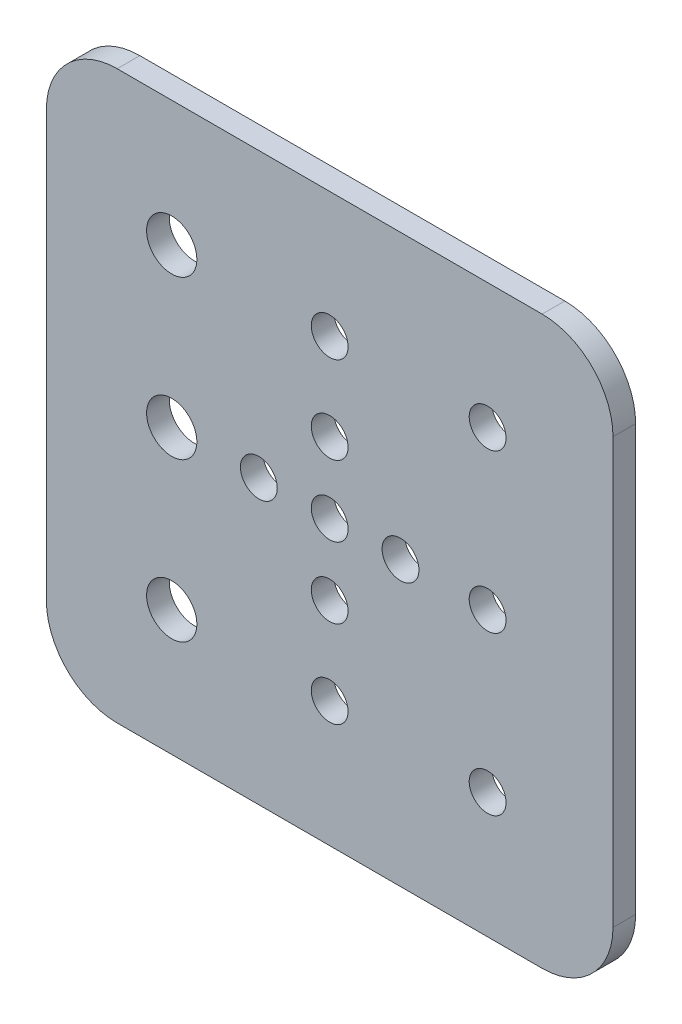
ISO-10303-21;
HEADER;
FILE_DESCRIPTION(('STEP AP214'),'2;1');
FILE_NAME('part.step','',(''),(''),'','','');
FILE_SCHEMA(('AUTOMOTIVE_DESIGN { 1 0 10303 214 1 1 1 1 }'));
ENDSEC;
DATA;
#1=APPLICATION_CONTEXT('core data for automotive mechanical design processes');
#2=APPLICATION_PROTOCOL_DEFINITION('international standard','automotive_design',2000,#1);
#3=PRODUCT_CONTEXT('',#1,'mechanical');
#4=PRODUCT('Part','Part','',(#3));
#5=PRODUCT_RELATED_PRODUCT_CATEGORY('part','',(#4));
#6=PRODUCT_DEFINITION_FORMATION('','',#4);
#7=PRODUCT_DEFINITION_CONTEXT('part definition',#1,'design');
#8=PRODUCT_DEFINITION('design','',#6,#7);
#9=PRODUCT_DEFINITION_SHAPE('','',#8);
#10=(LENGTH_UNIT() NAMED_UNIT(*) SI_UNIT(.MILLI.,.METRE.));
#11=(NAMED_UNIT(*) PLANE_ANGLE_UNIT() SI_UNIT($,.RADIAN.));
#12=(NAMED_UNIT(*) SI_UNIT($,.STERADIAN.) SOLID_ANGLE_UNIT());
#13=UNCERTAINTY_MEASURE_WITH_UNIT(LENGTH_MEASURE(1.E-05),#10,'distance_accuracy_value','');
#14=(GEOMETRIC_REPRESENTATION_CONTEXT(3) GLOBAL_UNCERTAINTY_ASSIGNED_CONTEXT((#13)) GLOBAL_UNIT_ASSIGNED_CONTEXT((#10,
#11,#12)) REPRESENTATION_CONTEXT('',''));
#15=CARTESIAN_POINT('',(0.,0.,0.));
#16=DIRECTION('',(0.,0.,1.));
#17=DIRECTION('',(1.,0.,0.));
#18=AXIS2_PLACEMENT_3D('',#15,#16,#17);
#19=CARTESIAN_POINT('',(0.,0.,3.2));
#20=DIRECTION('',(0.,0.,1.));
#21=DIRECTION('',(1.,0.,0.));
#22=AXIS2_PLACEMENT_3D('',#19,#20,#21);
#23=PLANE('',#22);
#24=CARTESIAN_POINT('',(-22.3,-22.3,3.2));
#25=DIRECTION('',(0.,0.,1.));
#26=DIRECTION('',(1.,0.,0.));
#27=AXIS2_PLACEMENT_3D('',#24,#25,#26);
#28=CIRCLE('',#27,3.55);
#29=CARTESIAN_POINT('',(-18.75,-22.3,3.2));
#30=VERTEX_POINT('',#29);
#31=EDGE_CURVE('E234',#30,#30,#28,.T.);
#32=ORIENTED_EDGE('',*,*,#31,.F.);
#33=EDGE_LOOP('',(#32));
#34=FACE_BOUND('',#33,.T.);
#35=CARTESIAN_POINT('',(22.3,22.3,3.2));
#36=DIRECTION('',(0.,0.,1.));
#37=DIRECTION('',(1.,0.,0.));
#38=AXIS2_PLACEMENT_3D('',#35,#36,#37);
#39=CIRCLE('',#38,2.6);
#40=CARTESIAN_POINT('',(24.9,22.3,3.2));
#41=VERTEX_POINT('',#40);
#42=EDGE_CURVE('E222',#41,#41,#39,.T.);
#43=ORIENTED_EDGE('',*,*,#42,.F.);
#44=EDGE_LOOP('',(#43));
#45=FACE_BOUND('',#44,.T.);
#46=CARTESIAN_POINT('',(-22.3,0.,3.2));
#47=DIRECTION('',(0.,0.,1.));
#48=DIRECTION('',(1.,0.,0.));
#49=AXIS2_PLACEMENT_3D('',#46,#47,#48);
#50=CIRCLE('',#49,3.55);
#51=CARTESIAN_POINT('',(-18.75,0.,3.2));
#52=VERTEX_POINT('',#51);
#53=EDGE_CURVE('E210',#52,#52,#50,.T.);
#54=ORIENTED_EDGE('',*,*,#53,.F.);
#55=EDGE_LOOP('',(#54));
#56=FACE_BOUND('',#55,.T.);
#57=CARTESIAN_POINT('',(10.,0.,3.2));
#58=DIRECTION('',(0.,0.,1.));
#59=DIRECTION('',(1.,0.,0.));
#60=AXIS2_PLACEMENT_3D('',#57,#58,#59);
#61=CIRCLE('',#60,2.6);
#62=CARTESIAN_POINT('',(12.6,0.,3.2));
#63=VERTEX_POINT('',#62);
#64=EDGE_CURVE('E198',#63,#63,#61,.T.);
#65=ORIENTED_EDGE('',*,*,#64,.F.);
#66=EDGE_LOOP('',(#65));
#67=FACE_BOUND('',#66,.T.);
#68=CARTESIAN_POINT('',(0.,-10.,3.2));
#69=DIRECTION('',(0.,0.,1.));
#70=DIRECTION('',(1.,0.,0.));
#71=AXIS2_PLACEMENT_3D('',#68,#69,#70);
#72=CIRCLE('',#71,2.6);
#73=CARTESIAN_POINT('',(2.60000000000001,-10.,3.2));
#74=VERTEX_POINT('',#73);
#75=EDGE_CURVE('E186',#74,#74,#72,.T.);
#76=ORIENTED_EDGE('',*,*,#75,.F.);
#77=EDGE_LOOP('',(#76));
#78=FACE_BOUND('',#77,.T.);
#79=CARTESIAN_POINT('',(0.,10.,3.2));
#80=DIRECTION('',(0.,0.,1.));
#81=DIRECTION('',(1.,0.,0.));
#82=AXIS2_PLACEMENT_3D('',#79,#80,#81);
#83=CIRCLE('',#82,2.6);
#84=CARTESIAN_POINT('',(2.6,10.,3.2));
#85=VERTEX_POINT('',#84);
#86=EDGE_CURVE('E175',#85,#85,#83,.T.);
#87=ORIENTED_EDGE('',*,*,#86,.F.);
#88=EDGE_LOOP('',(#87));
#89=FACE_BOUND('',#88,.T.);
#90=DIRECTION('',(0.,-1.,0.));
#91=VECTOR('',#90,1.);
#92=CARTESIAN_POINT('',(-40.,40.,3.2));
#93=LINE('',#92,#91);
#94=CARTESIAN_POINT('',(-40.,30.,3.2));
#95=VERTEX_POINT('',#94);
#96=CARTESIAN_POINT('',(-40.,-30.,3.2));
#97=VERTEX_POINT('',#96);
#98=EDGE_CURVE('E170',#95,#97,#93,.T.);
#99=ORIENTED_EDGE('',*,*,#98,.T.);
#100=CARTESIAN_POINT('',(-30.,-30.,3.2));
#101=DIRECTION('',(0.,0.,1.));
#102=DIRECTION('',(1.,0.,0.));
#103=AXIS2_PLACEMENT_3D('',#100,#101,#102);
#104=CIRCLE('',#103,10.);
#105=CARTESIAN_POINT('',(-30.,-40.,3.2));
#106=VERTEX_POINT('',#105);
#107=EDGE_CURVE('E147',#97,#106,#104,.T.);
#108=ORIENTED_EDGE('',*,*,#107,.T.);
#109=DIRECTION('',(1.,0.,0.));
#110=VECTOR('',#109,1.);
#111=CARTESIAN_POINT('',(-40.,-40.,3.2));
#112=LINE('',#111,#110);
#113=CARTESIAN_POINT('',(30.,-40.,3.2));
#114=VERTEX_POINT('',#113);
#115=EDGE_CURVE('E118',#106,#114,#112,.T.);
#116=ORIENTED_EDGE('',*,*,#115,.T.);
#117=CARTESIAN_POINT('',(30.,-30.,3.2));
#118=DIRECTION('',(0.,0.,1.));
#119=DIRECTION('',(1.,0.,0.));
#120=AXIS2_PLACEMENT_3D('',#117,#118,#119);
#121=CIRCLE('',#120,10.);
#122=CARTESIAN_POINT('',(40.,-30.,3.2));
#123=VERTEX_POINT('',#122);
#124=EDGE_CURVE('E145',#114,#123,#121,.T.);
#125=ORIENTED_EDGE('',*,*,#124,.T.);
#126=DIRECTION('',(0.,1.,0.));
#127=VECTOR('',#126,1.);
#128=CARTESIAN_POINT('',(40.,40.,3.2));
#129=LINE('',#128,#127);
#130=CARTESIAN_POINT('',(40.,30.,3.2));
#131=VERTEX_POINT('',#130);
#132=EDGE_CURVE('E125',#123,#131,#129,.T.);
#133=ORIENTED_EDGE('',*,*,#132,.T.);
#134=CARTESIAN_POINT('',(30.,30.,3.2));
#135=DIRECTION('',(0.,0.,1.));
#136=DIRECTION('',(1.,0.,0.));
#137=AXIS2_PLACEMENT_3D('',#134,#135,#136);
#138=CIRCLE('',#137,10.);
#139=CARTESIAN_POINT('',(30.,40.,3.2));
#140=VERTEX_POINT('',#139);
#141=EDGE_CURVE('E53',#131,#140,#138,.T.);
#142=ORIENTED_EDGE('',*,*,#141,.T.);
#143=DIRECTION('',(-1.,0.,0.));
#144=VECTOR('',#143,1.);
#145=CARTESIAN_POINT('',(-40.,40.,3.2));
#146=LINE('',#145,#144);
#147=CARTESIAN_POINT('',(-30.,40.,3.2));
#148=VERTEX_POINT('',#147);
#149=EDGE_CURVE('E128',#140,#148,#146,.T.);
#150=ORIENTED_EDGE('',*,*,#149,.T.);
#151=CARTESIAN_POINT('',(-30.,30.,3.2));
#152=DIRECTION('',(0.,0.,1.));
#153=DIRECTION('',(1.,0.,0.));
#154=AXIS2_PLACEMENT_3D('',#151,#152,#153);
#155=CIRCLE('',#154,10.);
#156=EDGE_CURVE('E142',#148,#95,#155,.T.);
#157=ORIENTED_EDGE('',*,*,#156,.T.);
#158=EDGE_LOOP('',(#99,#108,#116,#125,#133,#142,#150,#157));
#159=FACE_BOUND('',#158,.T.);
#160=CARTESIAN_POINT('',(0.,0.,3.2));
#161=DIRECTION('',(0.,0.,1.));
#162=DIRECTION('',(1.,0.,0.));
#163=AXIS2_PLACEMENT_3D('',#160,#161,#162);
#164=CIRCLE('',#163,2.6);
#165=CARTESIAN_POINT('',(2.59999999999999,0.,3.2));
#166=VERTEX_POINT('',#165);
#167=EDGE_CURVE('E163',#166,#166,#164,.T.);
#168=ORIENTED_EDGE('',*,*,#167,.F.);
#169=EDGE_LOOP('',(#168));
#170=FACE_BOUND('',#169,.T.);
#171=CARTESIAN_POINT('',(0.,22.3,3.2));
#172=DIRECTION('',(0.,0.,1.));
#173=DIRECTION('',(1.,0.,0.));
#174=AXIS2_PLACEMENT_3D('',#171,#172,#173);
#175=CIRCLE('',#174,2.6);
#176=CARTESIAN_POINT('',(2.6,22.3,3.2));
#177=VERTEX_POINT('',#176);
#178=EDGE_CURVE('E180',#177,#177,#175,.T.);
#179=ORIENTED_EDGE('',*,*,#178,.F.);
#180=EDGE_LOOP('',(#179));
#181=FACE_BOUND('',#180,.T.);
#182=CARTESIAN_POINT('',(0.,-22.3,3.2));
#183=DIRECTION('',(0.,0.,1.));
#184=DIRECTION('',(1.,0.,0.));
#185=AXIS2_PLACEMENT_3D('',#182,#183,#184);
#186=CIRCLE('',#185,2.6);
#187=CARTESIAN_POINT('',(2.60000000000001,-22.3,3.2));
#188=VERTEX_POINT('',#187);
#189=EDGE_CURVE('E192',#188,#188,#186,.T.);
#190=ORIENTED_EDGE('',*,*,#189,.F.);
#191=EDGE_LOOP('',(#190));
#192=FACE_BOUND('',#191,.T.);
#193=CARTESIAN_POINT('',(-10.,0.,3.2));
#194=DIRECTION('',(0.,0.,1.));
#195=DIRECTION('',(1.,0.,0.));
#196=AXIS2_PLACEMENT_3D('',#193,#194,#195);
#197=CIRCLE('',#196,2.6);
#198=CARTESIAN_POINT('',(-7.4,0.,3.2));
#199=VERTEX_POINT('',#198);
#200=EDGE_CURVE('E204',#199,#199,#197,.T.);
#201=ORIENTED_EDGE('',*,*,#200,.F.);
#202=EDGE_LOOP('',(#201));
#203=FACE_BOUND('',#202,.T.);
#204=CARTESIAN_POINT('',(22.3,0.,3.2));
#205=DIRECTION('',(0.,0.,1.));
#206=DIRECTION('',(1.,0.,0.));
#207=AXIS2_PLACEMENT_3D('',#204,#205,#206);
#208=CIRCLE('',#207,2.6);
#209=CARTESIAN_POINT('',(24.9,0.,3.2));
#210=VERTEX_POINT('',#209);
#211=EDGE_CURVE('E216',#210,#210,#208,.T.);
#212=ORIENTED_EDGE('',*,*,#211,.F.);
#213=EDGE_LOOP('',(#212));
#214=FACE_BOUND('',#213,.T.);
#215=CARTESIAN_POINT('',(22.3,-22.3,3.2));
#216=DIRECTION('',(0.,0.,1.));
#217=DIRECTION('',(1.,0.,0.));
#218=AXIS2_PLACEMENT_3D('',#215,#216,#217);
#219=CIRCLE('',#218,2.6);
#220=CARTESIAN_POINT('',(24.9,-22.3,3.2));
#221=VERTEX_POINT('',#220);
#222=EDGE_CURVE('E228',#221,#221,#219,.T.);
#223=ORIENTED_EDGE('',*,*,#222,.F.);
#224=EDGE_LOOP('',(#223));
#225=FACE_BOUND('',#224,.T.);
#226=CARTESIAN_POINT('',(-22.3,22.3,3.2));
#227=DIRECTION('',(0.,0.,1.));
#228=DIRECTION('',(1.,0.,0.));
#229=AXIS2_PLACEMENT_3D('',#226,#227,#228);
#230=CIRCLE('',#229,3.55);
#231=CARTESIAN_POINT('',(-18.75,22.3,3.2));
#232=VERTEX_POINT('',#231);
#233=EDGE_CURVE('E240',#232,#232,#230,.T.);
#234=ORIENTED_EDGE('',*,*,#233,.F.);
#235=EDGE_LOOP('',(#234));
#236=FACE_BOUND('',#235,.T.);
#237=ADVANCED_FACE('F32',(#34,#45,#56,#67,#78,#89,#159,#170,#181,#192,#203,#214,#225,#236),#23,.T.);
#238=CARTESIAN_POINT('',(0.,0.,0.));
#239=DIRECTION('',(0.,0.,1.));
#240=DIRECTION('',(1.,0.,0.));
#241=AXIS2_PLACEMENT_3D('',#238,#239,#240);
#242=PLANE('',#241);
#243=CARTESIAN_POINT('',(-22.3,-22.3,0.));
#244=DIRECTION('',(0.,0.,1.));
#245=DIRECTION('',(1.,0.,0.));
#246=AXIS2_PLACEMENT_3D('',#243,#244,#245);
#247=CIRCLE('',#246,3.55);
#248=CARTESIAN_POINT('',(-18.75,-22.3,0.));
#249=VERTEX_POINT('',#248);
#250=EDGE_CURVE('E237',#249,#249,#247,.T.);
#251=ORIENTED_EDGE('',*,*,#250,.T.);
#252=EDGE_LOOP('',(#251));
#253=FACE_BOUND('',#252,.T.);
#254=CARTESIAN_POINT('',(22.3,22.3,0.));
#255=DIRECTION('',(0.,0.,1.));
#256=DIRECTION('',(1.,0.,0.));
#257=AXIS2_PLACEMENT_3D('',#254,#255,#256);
#258=CIRCLE('',#257,2.6);
#259=CARTESIAN_POINT('',(24.9,22.3,0.));
#260=VERTEX_POINT('',#259);
#261=EDGE_CURVE('E225',#260,#260,#258,.T.);
#262=ORIENTED_EDGE('',*,*,#261,.T.);
#263=EDGE_LOOP('',(#262));
#264=FACE_BOUND('',#263,.T.);
#265=CARTESIAN_POINT('',(-22.3,0.,0.));
#266=DIRECTION('',(0.,0.,1.));
#267=DIRECTION('',(1.,0.,0.));
#268=AXIS2_PLACEMENT_3D('',#265,#266,#267);
#269=CIRCLE('',#268,3.55);
#270=CARTESIAN_POINT('',(-18.75,0.,0.));
#271=VERTEX_POINT('',#270);
#272=EDGE_CURVE('E213',#271,#271,#269,.T.);
#273=ORIENTED_EDGE('',*,*,#272,.T.);
#274=EDGE_LOOP('',(#273));
#275=FACE_BOUND('',#274,.T.);
#276=CARTESIAN_POINT('',(10.,0.,0.));
#277=DIRECTION('',(0.,0.,1.));
#278=DIRECTION('',(1.,0.,0.));
#279=AXIS2_PLACEMENT_3D('',#276,#277,#278);
#280=CIRCLE('',#279,2.6);
#281=CARTESIAN_POINT('',(12.6,0.,0.));
#282=VERTEX_POINT('',#281);
#283=EDGE_CURVE('E201',#282,#282,#280,.T.);
#284=ORIENTED_EDGE('',*,*,#283,.T.);
#285=EDGE_LOOP('',(#284));
#286=FACE_BOUND('',#285,.T.);
#287=CARTESIAN_POINT('',(0.,-10.,0.));
#288=DIRECTION('',(0.,0.,1.));
#289=DIRECTION('',(1.,0.,0.));
#290=AXIS2_PLACEMENT_3D('',#287,#288,#289);
#291=CIRCLE('',#290,2.6);
#292=CARTESIAN_POINT('',(2.60000000000001,-10.,0.));
#293=VERTEX_POINT('',#292);
#294=EDGE_CURVE('E189',#293,#293,#291,.T.);
#295=ORIENTED_EDGE('',*,*,#294,.T.);
#296=EDGE_LOOP('',(#295));
#297=FACE_BOUND('',#296,.T.);
#298=CARTESIAN_POINT('',(0.,10.,0.));
#299=DIRECTION('',(0.,0.,1.));
#300=DIRECTION('',(1.,0.,0.));
#301=AXIS2_PLACEMENT_3D('',#298,#299,#300);
#302=CIRCLE('',#301,2.6);
#303=CARTESIAN_POINT('',(2.6,10.,0.));
#304=VERTEX_POINT('',#303);
#305=EDGE_CURVE('E177',#304,#304,#302,.T.);
#306=ORIENTED_EDGE('',*,*,#305,.T.);
#307=EDGE_LOOP('',(#306));
#308=FACE_BOUND('',#307,.T.);
#309=DIRECTION('',(1.,0.,0.));
#310=VECTOR('',#309,1.);
#311=CARTESIAN_POINT('',(-40.,-40.,0.));
#312=LINE('',#311,#310);
#313=CARTESIAN_POINT('',(-30.,-40.,0.));
#314=VERTEX_POINT('',#313);
#315=CARTESIAN_POINT('',(30.,-40.,0.));
#316=VERTEX_POINT('',#315);
#317=EDGE_CURVE('E115',#314,#316,#312,.T.);
#318=ORIENTED_EDGE('',*,*,#317,.F.);
#319=CARTESIAN_POINT('',(-30.,-30.,0.));
#320=DIRECTION('',(0.,0.,1.));
#321=DIRECTION('',(1.,0.,0.));
#322=AXIS2_PLACEMENT_3D('',#319,#320,#321);
#323=CIRCLE('',#322,10.);
#324=CARTESIAN_POINT('',(-40.,-30.,0.));
#325=VERTEX_POINT('',#324);
#326=EDGE_CURVE('E98',#314,#325,#323,.F.);
#327=ORIENTED_EDGE('',*,*,#326,.T.);
#328=DIRECTION('',(0.,-1.,0.));
#329=VECTOR('',#328,1.);
#330=CARTESIAN_POINT('',(-40.,40.,0.));
#331=LINE('',#330,#329);
#332=CARTESIAN_POINT('',(-40.,30.,0.));
#333=VERTEX_POINT('',#332);
#334=EDGE_CURVE('E126',#333,#325,#331,.T.);
#335=ORIENTED_EDGE('',*,*,#334,.F.);
#336=CARTESIAN_POINT('',(-30.,30.,0.));
#337=DIRECTION('',(0.,0.,1.));
#338=DIRECTION('',(1.,0.,0.));
#339=AXIS2_PLACEMENT_3D('',#336,#337,#338);
#340=CIRCLE('',#339,10.);
#341=CARTESIAN_POINT('',(-30.,40.,0.));
#342=VERTEX_POINT('',#341);
#343=EDGE_CURVE('E119',#333,#342,#340,.F.);
#344=ORIENTED_EDGE('',*,*,#343,.T.);
#345=DIRECTION('',(-1.,0.,0.));
#346=VECTOR('',#345,1.);
#347=CARTESIAN_POINT('',(-40.,40.,0.));
#348=LINE('',#347,#346);
#349=CARTESIAN_POINT('',(30.,40.,0.));
#350=VERTEX_POINT('',#349);
#351=EDGE_CURVE('E130',#350,#342,#348,.T.);
#352=ORIENTED_EDGE('',*,*,#351,.F.);
#353=CARTESIAN_POINT('',(30.,30.,0.));
#354=DIRECTION('',(0.,0.,1.));
#355=DIRECTION('',(1.,0.,0.));
#356=AXIS2_PLACEMENT_3D('',#353,#354,#355);
#357=CIRCLE('',#356,10.);
#358=CARTESIAN_POINT('',(40.,30.,0.));
#359=VERTEX_POINT('',#358);
#360=EDGE_CURVE('E136',#350,#359,#357,.F.);
#361=ORIENTED_EDGE('',*,*,#360,.T.);
#362=DIRECTION('',(0.,1.,0.));
#363=VECTOR('',#362,1.);
#364=CARTESIAN_POINT('',(40.,40.,0.));
#365=LINE('',#364,#363);
#366=CARTESIAN_POINT('',(40.,-30.,0.));
#367=VERTEX_POINT('',#366);
#368=EDGE_CURVE('E158',#367,#359,#365,.T.);
#369=ORIENTED_EDGE('',*,*,#368,.F.);
#370=CARTESIAN_POINT('',(30.,-30.,0.));
#371=DIRECTION('',(0.,0.,1.));
#372=DIRECTION('',(1.,0.,0.));
#373=AXIS2_PLACEMENT_3D('',#370,#371,#372);
#374=CIRCLE('',#373,10.);
#375=EDGE_CURVE('E109',#367,#316,#374,.F.);
#376=ORIENTED_EDGE('',*,*,#375,.T.);
#377=EDGE_LOOP('',(#318,#327,#335,#344,#352,#361,#369,#376));
#378=FACE_BOUND('',#377,.T.);
#379=CARTESIAN_POINT('',(0.,0.,0.));
#380=DIRECTION('',(0.,0.,1.));
#381=DIRECTION('',(1.,0.,0.));
#382=AXIS2_PLACEMENT_3D('',#379,#380,#381);
#383=CIRCLE('',#382,2.6);
#384=CARTESIAN_POINT('',(2.59999999999999,0.,0.));
#385=VERTEX_POINT('',#384);
#386=EDGE_CURVE('E166',#385,#385,#383,.T.);
#387=ORIENTED_EDGE('',*,*,#386,.T.);
#388=EDGE_LOOP('',(#387));
#389=FACE_BOUND('',#388,.T.);
#390=CARTESIAN_POINT('',(0.,22.3,0.));
#391=DIRECTION('',(0.,0.,1.));
#392=DIRECTION('',(1.,0.,0.));
#393=AXIS2_PLACEMENT_3D('',#390,#391,#392);
#394=CIRCLE('',#393,2.6);
#395=CARTESIAN_POINT('',(2.6,22.3,0.));
#396=VERTEX_POINT('',#395);
#397=EDGE_CURVE('E183',#396,#396,#394,.T.);
#398=ORIENTED_EDGE('',*,*,#397,.T.);
#399=EDGE_LOOP('',(#398));
#400=FACE_BOUND('',#399,.T.);
#401=CARTESIAN_POINT('',(0.,-22.3,0.));
#402=DIRECTION('',(0.,0.,1.));
#403=DIRECTION('',(1.,0.,0.));
#404=AXIS2_PLACEMENT_3D('',#401,#402,#403);
#405=CIRCLE('',#404,2.6);
#406=CARTESIAN_POINT('',(2.60000000000001,-22.3,0.));
#407=VERTEX_POINT('',#406);
#408=EDGE_CURVE('E195',#407,#407,#405,.T.);
#409=ORIENTED_EDGE('',*,*,#408,.T.);
#410=EDGE_LOOP('',(#409));
#411=FACE_BOUND('',#410,.T.);
#412=CARTESIAN_POINT('',(-10.,0.,0.));
#413=DIRECTION('',(0.,0.,1.));
#414=DIRECTION('',(1.,0.,0.));
#415=AXIS2_PLACEMENT_3D('',#412,#413,#414);
#416=CIRCLE('',#415,2.6);
#417=CARTESIAN_POINT('',(-7.4,0.,0.));
#418=VERTEX_POINT('',#417);
#419=EDGE_CURVE('E207',#418,#418,#416,.T.);
#420=ORIENTED_EDGE('',*,*,#419,.T.);
#421=EDGE_LOOP('',(#420));
#422=FACE_BOUND('',#421,.T.);
#423=CARTESIAN_POINT('',(22.3,0.,0.));
#424=DIRECTION('',(0.,0.,1.));
#425=DIRECTION('',(1.,0.,0.));
#426=AXIS2_PLACEMENT_3D('',#423,#424,#425);
#427=CIRCLE('',#426,2.6);
#428=CARTESIAN_POINT('',(24.9,0.,0.));
#429=VERTEX_POINT('',#428);
#430=EDGE_CURVE('E219',#429,#429,#427,.T.);
#431=ORIENTED_EDGE('',*,*,#430,.T.);
#432=EDGE_LOOP('',(#431));
#433=FACE_BOUND('',#432,.T.);
#434=CARTESIAN_POINT('',(22.3,-22.3,0.));
#435=DIRECTION('',(0.,0.,1.));
#436=DIRECTION('',(1.,0.,0.));
#437=AXIS2_PLACEMENT_3D('',#434,#435,#436);
#438=CIRCLE('',#437,2.6);
#439=CARTESIAN_POINT('',(24.9,-22.3,0.));
#440=VERTEX_POINT('',#439);
#441=EDGE_CURVE('E231',#440,#440,#438,.T.);
#442=ORIENTED_EDGE('',*,*,#441,.T.);
#443=EDGE_LOOP('',(#442));
#444=FACE_BOUND('',#443,.T.);
#445=CARTESIAN_POINT('',(-22.3,22.3,0.));
#446=DIRECTION('',(0.,0.,1.));
#447=DIRECTION('',(1.,0.,0.));
#448=AXIS2_PLACEMENT_3D('',#445,#446,#447);
#449=CIRCLE('',#448,3.55);
#450=CARTESIAN_POINT('',(-18.75,22.3,0.));
#451=VERTEX_POINT('',#450);
#452=EDGE_CURVE('E243',#451,#451,#449,.T.);
#453=ORIENTED_EDGE('',*,*,#452,.T.);
#454=EDGE_LOOP('',(#453));
#455=FACE_BOUND('',#454,.T.);
#456=ADVANCED_FACE('F122',(#253,#264,#275,#286,#297,#308,#378,#389,#400,#411,#422,#433,#444,
#455),#242,.F.);
#457=CARTESIAN_POINT('',(40.,40.,3.2));
#458=DIRECTION('',(-1.,0.,0.));
#459=DIRECTION('',(0.,-1.,0.));
#460=AXIS2_PLACEMENT_3D('',#457,#458,#459);
#461=PLANE('',#460);
#462=ORIENTED_EDGE('',*,*,#132,.F.);
#463=DIRECTION('',(0.,0.,-1.));
#464=VECTOR('',#463,1.);
#465=CARTESIAN_POINT('',(40.,-30.,3.2));
#466=LINE('',#465,#464);
#467=EDGE_CURVE('E151',#123,#367,#466,.T.);
#468=ORIENTED_EDGE('',*,*,#467,.T.);
#469=ORIENTED_EDGE('',*,*,#368,.T.);
#470=DIRECTION('',(0.,0.,-1.));
#471=VECTOR('',#470,1.);
#472=CARTESIAN_POINT('',(40.,30.,3.2));
#473=LINE('',#472,#471);
#474=EDGE_CURVE('E149',#359,#131,#473,.F.);
#475=ORIENTED_EDGE('',*,*,#474,.T.);
#476=EDGE_LOOP('',(#462,#468,#469,#475));
#477=FACE_BOUND('',#476,.T.);
#478=ADVANCED_FACE('F157',(#477),#461,.F.);
#479=CARTESIAN_POINT('',(-40.,40.,3.2));
#480=DIRECTION('',(0.,-1.,0.));
#481=DIRECTION('',(0.,0.,-1.));
#482=AXIS2_PLACEMENT_3D('',#479,#480,#481);
#483=PLANE('',#482);
#484=ORIENTED_EDGE('',*,*,#149,.F.);
#485=DIRECTION('',(0.,0.,-1.));
#486=VECTOR('',#485,1.);
#487=CARTESIAN_POINT('',(30.,40.,3.2));
#488=LINE('',#487,#486);
#489=EDGE_CURVE('E11',#140,#350,#488,.T.);
#490=ORIENTED_EDGE('',*,*,#489,.T.);
#491=ORIENTED_EDGE('',*,*,#351,.T.);
#492=DIRECTION('',(0.,0.,-1.));
#493=VECTOR('',#492,1.);
#494=CARTESIAN_POINT('',(-30.,40.,3.2));
#495=LINE('',#494,#493);
#496=EDGE_CURVE('E40',#342,#148,#495,.F.);
#497=ORIENTED_EDGE('',*,*,#496,.T.);
#498=EDGE_LOOP('',(#484,#490,#491,#497));
#499=FACE_BOUND('',#498,.T.);
#500=ADVANCED_FACE('F271',(#499),#483,.F.);
#501=CARTESIAN_POINT('',(-40.,40.,3.2));
#502=DIRECTION('',(1.,0.,0.));
#503=DIRECTION('',(0.,1.,0.));
#504=AXIS2_PLACEMENT_3D('',#501,#502,#503);
#505=PLANE('',#504);
#506=ORIENTED_EDGE('',*,*,#334,.T.);
#507=DIRECTION('',(0.,0.,-1.));
#508=VECTOR('',#507,1.);
#509=CARTESIAN_POINT('',(-40.,-30.,3.2));
#510=LINE('',#509,#508);
#511=EDGE_CURVE('E103',#325,#97,#510,.F.);
#512=ORIENTED_EDGE('',*,*,#511,.T.);
#513=ORIENTED_EDGE('',*,*,#98,.F.);
#514=DIRECTION('',(0.,0.,-1.));
#515=VECTOR('',#514,1.);
#516=CARTESIAN_POINT('',(-40.,30.,3.2));
#517=LINE('',#516,#515);
#518=EDGE_CURVE('E108',#95,#333,#517,.T.);
#519=ORIENTED_EDGE('',*,*,#518,.T.);
#520=EDGE_LOOP('',(#506,#512,#513,#519));
#521=FACE_BOUND('',#520,.T.);
#522=ADVANCED_FACE('F268',(#521),#505,.F.);
#523=CARTESIAN_POINT('',(-40.,-40.,3.2));
#524=DIRECTION('',(0.,1.,0.));
#525=DIRECTION('',(0.,0.,1.));
#526=AXIS2_PLACEMENT_3D('',#523,#524,#525);
#527=PLANE('',#526);
#528=ORIENTED_EDGE('',*,*,#115,.F.);
#529=DIRECTION('',(0.,0.,-1.));
#530=VECTOR('',#529,1.);
#531=CARTESIAN_POINT('',(-30.,-40.,3.2));
#532=LINE('',#531,#530);
#533=EDGE_CURVE('E102',#106,#314,#532,.T.);
#534=ORIENTED_EDGE('',*,*,#533,.T.);
#535=ORIENTED_EDGE('',*,*,#317,.T.);
#536=DIRECTION('',(0.,0.,-1.));
#537=VECTOR('',#536,1.);
#538=CARTESIAN_POINT('',(30.,-40.,3.2));
#539=LINE('',#538,#537);
#540=EDGE_CURVE('E120',#316,#114,#539,.F.);
#541=ORIENTED_EDGE('',*,*,#540,.T.);
#542=EDGE_LOOP('',(#528,#534,#535,#541));
#543=FACE_BOUND('',#542,.T.);
#544=ADVANCED_FACE('F114',(#543),#527,.F.);
#545=CARTESIAN_POINT('',(0.,0.,3.2));
#546=DIRECTION('',(0.,0.,-1.));
#547=DIRECTION('',(-1.,0.,0.));
#548=AXIS2_PLACEMENT_3D('',#545,#546,#547);
#549=CYLINDRICAL_SURFACE('',#548,2.6);
#550=ORIENTED_EDGE('',*,*,#167,.T.);
#551=EDGE_LOOP('',(#550));
#552=FACE_BOUND('',#551,.T.);
#553=ORIENTED_EDGE('',*,*,#386,.F.);
#554=EDGE_LOOP('',(#553));
#555=FACE_BOUND('',#554,.T.);
#556=ADVANCED_FACE('F263',(#552,#555),#549,.F.);
#557=CARTESIAN_POINT('',(0.,10.,3.2));
#558=DIRECTION('',(0.,0.,-1.));
#559=DIRECTION('',(-1.,0.,0.));
#560=AXIS2_PLACEMENT_3D('',#557,#558,#559);
#561=CYLINDRICAL_SURFACE('',#560,2.6);
#562=ORIENTED_EDGE('',*,*,#86,.T.);
#563=EDGE_LOOP('',(#562));
#564=FACE_BOUND('',#563,.T.);
#565=ORIENTED_EDGE('',*,*,#305,.F.);
#566=EDGE_LOOP('',(#565));
#567=FACE_BOUND('',#566,.T.);
#568=ADVANCED_FACE('F352',(#564,#567),#561,.F.);
#569=CARTESIAN_POINT('',(0.,22.3,3.2));
#570=DIRECTION('',(0.,0.,-1.));
#571=DIRECTION('',(-1.,0.,0.));
#572=AXIS2_PLACEMENT_3D('',#569,#570,#571);
#573=CYLINDRICAL_SURFACE('',#572,2.6);
#574=ORIENTED_EDGE('',*,*,#178,.T.);
#575=EDGE_LOOP('',(#574));
#576=FACE_BOUND('',#575,.T.);
#577=ORIENTED_EDGE('',*,*,#397,.F.);
#578=EDGE_LOOP('',(#577));
#579=FACE_BOUND('',#578,.T.);
#580=ADVANCED_FACE('F349',(#576,#579),#573,.F.);
#581=CARTESIAN_POINT('',(0.,-10.,3.2));
#582=DIRECTION('',(0.,0.,-1.));
#583=DIRECTION('',(-1.,0.,0.));
#584=AXIS2_PLACEMENT_3D('',#581,#582,#583);
#585=CYLINDRICAL_SURFACE('',#584,2.6);
#586=ORIENTED_EDGE('',*,*,#75,.T.);
#587=EDGE_LOOP('',(#586));
#588=FACE_BOUND('',#587,.T.);
#589=ORIENTED_EDGE('',*,*,#294,.F.);
#590=EDGE_LOOP('',(#589));
#591=FACE_BOUND('',#590,.T.);
#592=ADVANCED_FACE('F345',(#588,#591),#585,.F.);
#593=CARTESIAN_POINT('',(0.,-22.3,3.2));
#594=DIRECTION('',(0.,0.,-1.));
#595=DIRECTION('',(-1.,0.,0.));
#596=AXIS2_PLACEMENT_3D('',#593,#594,#595);
#597=CYLINDRICAL_SURFACE('',#596,2.6);
#598=ORIENTED_EDGE('',*,*,#189,.T.);
#599=EDGE_LOOP('',(#598));
#600=FACE_BOUND('',#599,.T.);
#601=ORIENTED_EDGE('',*,*,#408,.F.);
#602=EDGE_LOOP('',(#601));
#603=FACE_BOUND('',#602,.T.);
#604=ADVANCED_FACE('F341',(#600,#603),#597,.F.);
#605=CARTESIAN_POINT('',(10.,0.,3.2));
#606=DIRECTION('',(0.,0.,-1.));
#607=DIRECTION('',(-1.,0.,0.));
#608=AXIS2_PLACEMENT_3D('',#605,#606,#607);
#609=CYLINDRICAL_SURFACE('',#608,2.6);
#610=ORIENTED_EDGE('',*,*,#64,.T.);
#611=EDGE_LOOP('',(#610));
#612=FACE_BOUND('',#611,.T.);
#613=ORIENTED_EDGE('',*,*,#283,.F.);
#614=EDGE_LOOP('',(#613));
#615=FACE_BOUND('',#614,.T.);
#616=ADVANCED_FACE('F337',(#612,#615),#609,.F.);
#617=CARTESIAN_POINT('',(-10.,0.,3.2));
#618=DIRECTION('',(0.,0.,-1.));
#619=DIRECTION('',(-1.,0.,0.));
#620=AXIS2_PLACEMENT_3D('',#617,#618,#619);
#621=CYLINDRICAL_SURFACE('',#620,2.6);
#622=ORIENTED_EDGE('',*,*,#200,.T.);
#623=EDGE_LOOP('',(#622));
#624=FACE_BOUND('',#623,.T.);
#625=ORIENTED_EDGE('',*,*,#419,.F.);
#626=EDGE_LOOP('',(#625));
#627=FACE_BOUND('',#626,.T.);
#628=ADVANCED_FACE('F333',(#624,#627),#621,.F.);
#629=CARTESIAN_POINT('',(-22.3,0.,3.2));
#630=DIRECTION('',(0.,0.,-1.));
#631=DIRECTION('',(-1.,0.,0.));
#632=AXIS2_PLACEMENT_3D('',#629,#630,#631);
#633=CYLINDRICAL_SURFACE('',#632,3.55);
#634=ORIENTED_EDGE('',*,*,#53,.T.);
#635=EDGE_LOOP('',(#634));
#636=FACE_BOUND('',#635,.T.);
#637=ORIENTED_EDGE('',*,*,#272,.F.);
#638=EDGE_LOOP('',(#637));
#639=FACE_BOUND('',#638,.T.);
#640=ADVANCED_FACE('F329',(#636,#639),#633,.F.);
#641=CARTESIAN_POINT('',(22.3,0.,3.2));
#642=DIRECTION('',(0.,0.,-1.));
#643=DIRECTION('',(-1.,0.,0.));
#644=AXIS2_PLACEMENT_3D('',#641,#642,#643);
#645=CYLINDRICAL_SURFACE('',#644,2.6);
#646=ORIENTED_EDGE('',*,*,#211,.T.);
#647=EDGE_LOOP('',(#646));
#648=FACE_BOUND('',#647,.T.);
#649=ORIENTED_EDGE('',*,*,#430,.F.);
#650=EDGE_LOOP('',(#649));
#651=FACE_BOUND('',#650,.T.);
#652=ADVANCED_FACE('F325',(#648,#651),#645,.F.);
#653=CARTESIAN_POINT('',(22.3,22.3,3.2));
#654=DIRECTION('',(0.,0.,-1.));
#655=DIRECTION('',(-1.,0.,0.));
#656=AXIS2_PLACEMENT_3D('',#653,#654,#655);
#657=CYLINDRICAL_SURFACE('',#656,2.6);
#658=ORIENTED_EDGE('',*,*,#42,.T.);
#659=EDGE_LOOP('',(#658));
#660=FACE_BOUND('',#659,.T.);
#661=ORIENTED_EDGE('',*,*,#261,.F.);
#662=EDGE_LOOP('',(#661));
#663=FACE_BOUND('',#662,.T.);
#664=ADVANCED_FACE('F309',(#660,#663),#657,.F.);
#665=CARTESIAN_POINT('',(22.3,-22.3,3.2));
#666=DIRECTION('',(0.,0.,-1.));
#667=DIRECTION('',(-1.,0.,0.));
#668=AXIS2_PLACEMENT_3D('',#665,#666,#667);
#669=CYLINDRICAL_SURFACE('',#668,2.6);
#670=ORIENTED_EDGE('',*,*,#222,.T.);
#671=EDGE_LOOP('',(#670));
#672=FACE_BOUND('',#671,.T.);
#673=ORIENTED_EDGE('',*,*,#441,.F.);
#674=EDGE_LOOP('',(#673));
#675=FACE_BOUND('',#674,.T.);
#676=ADVANCED_FACE('F305',(#672,#675),#669,.F.);
#677=CARTESIAN_POINT('',(-22.3,-22.3,3.2));
#678=DIRECTION('',(0.,0.,-1.));
#679=DIRECTION('',(-1.,0.,0.));
#680=AXIS2_PLACEMENT_3D('',#677,#678,#679);
#681=CYLINDRICAL_SURFACE('',#680,3.55);
#682=ORIENTED_EDGE('',*,*,#31,.T.);
#683=EDGE_LOOP('',(#682));
#684=FACE_BOUND('',#683,.T.);
#685=ORIENTED_EDGE('',*,*,#250,.F.);
#686=EDGE_LOOP('',(#685));
#687=FACE_BOUND('',#686,.T.);
#688=ADVANCED_FACE('F308',(#684,#687),#681,.F.);
#689=CARTESIAN_POINT('',(-22.3,22.3,3.2));
#690=DIRECTION('',(0.,0.,-1.));
#691=DIRECTION('',(-1.,0.,0.));
#692=AXIS2_PLACEMENT_3D('',#689,#690,#691);
#693=CYLINDRICAL_SURFACE('',#692,3.55);
#694=ORIENTED_EDGE('',*,*,#233,.T.);
#695=EDGE_LOOP('',(#694));
#696=FACE_BOUND('',#695,.T.);
#697=ORIENTED_EDGE('',*,*,#452,.F.);
#698=EDGE_LOOP('',(#697));
#699=FACE_BOUND('',#698,.T.);
#700=ADVANCED_FACE('F249',(#696,#699),#693,.F.);
#701=CARTESIAN_POINT('',(-30.,-30.,3.2));
#702=DIRECTION('',(0.,0.,-1.));
#703=DIRECTION('',(-1.,0.,0.));
#704=AXIS2_PLACEMENT_3D('',#701,#702,#703);
#705=CYLINDRICAL_SURFACE('',#704,10.);
#706=ORIENTED_EDGE('',*,*,#107,.F.);
#707=ORIENTED_EDGE('',*,*,#511,.F.);
#708=ORIENTED_EDGE('',*,*,#326,.F.);
#709=ORIENTED_EDGE('',*,*,#533,.F.);
#710=EDGE_LOOP('',(#706,#707,#708,#709));
#711=FACE_BOUND('',#710,.T.);
#712=ADVANCED_FACE('F101',(#711),#705,.T.);
#713=CARTESIAN_POINT('',(30.,-30.,3.2));
#714=DIRECTION('',(0.,0.,-1.));
#715=DIRECTION('',(-1.,0.,0.));
#716=AXIS2_PLACEMENT_3D('',#713,#714,#715);
#717=CYLINDRICAL_SURFACE('',#716,10.);
#718=ORIENTED_EDGE('',*,*,#124,.F.);
#719=ORIENTED_EDGE('',*,*,#540,.F.);
#720=ORIENTED_EDGE('',*,*,#375,.F.);
#721=ORIENTED_EDGE('',*,*,#467,.F.);
#722=EDGE_LOOP('',(#718,#719,#720,#721));
#723=FACE_BOUND('',#722,.T.);
#724=ADVANCED_FACE('F279',(#723),#717,.T.);
#725=CARTESIAN_POINT('',(30.,30.,3.2));
#726=DIRECTION('',(0.,0.,-1.));
#727=DIRECTION('',(-1.,0.,0.));
#728=AXIS2_PLACEMENT_3D('',#725,#726,#727);
#729=CYLINDRICAL_SURFACE('',#728,10.);
#730=ORIENTED_EDGE('',*,*,#141,.F.);
#731=ORIENTED_EDGE('',*,*,#474,.F.);
#732=ORIENTED_EDGE('',*,*,#360,.F.);
#733=ORIENTED_EDGE('',*,*,#489,.F.);
#734=EDGE_LOOP('',(#730,#731,#732,#733));
#735=FACE_BOUND('',#734,.T.);
#736=ADVANCED_FACE('F281',(#735),#729,.T.);
#737=CARTESIAN_POINT('',(-30.,30.,3.2));
#738=DIRECTION('',(0.,0.,-1.));
#739=DIRECTION('',(-1.,0.,0.));
#740=AXIS2_PLACEMENT_3D('',#737,#738,#739);
#741=CYLINDRICAL_SURFACE('',#740,10.);
#742=ORIENTED_EDGE('',*,*,#156,.F.);
#743=ORIENTED_EDGE('',*,*,#496,.F.);
#744=ORIENTED_EDGE('',*,*,#343,.F.);
#745=ORIENTED_EDGE('',*,*,#518,.F.);
#746=EDGE_LOOP('',(#742,#743,#744,#745));
#747=FACE_BOUND('',#746,.T.);
#748=ADVANCED_FACE('F34',(#747),#741,.T.);
#749=CLOSED_SHELL('',(#237,#456,#478,#500,#522,#544,#556,#568,#580,#592,#604,#616,#628,#640,
#652,#664,#676,#688,#700,#712,#724,#736,#748));
#750=MANIFOLD_SOLID_BREP('B2',#749);
#751=ADVANCED_BREP_SHAPE_REPRESENTATION('',(#18,#750),#14);
#752=SHAPE_DEFINITION_REPRESENTATION(#9,#751);
ENDSEC;
END-ISO-10303-21;
